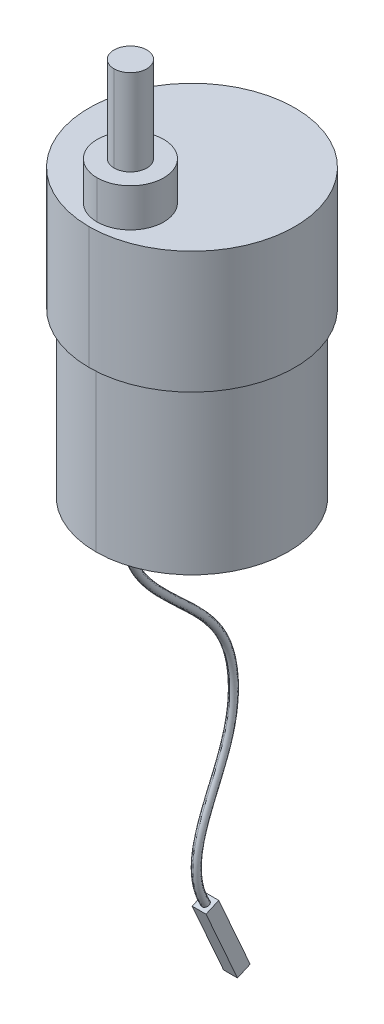
ISO-10303-21;
HEADER;
FILE_DESCRIPTION(('STEP AP214'),'2;1');
FILE_NAME('part.step','',(''),(''),'','','');
FILE_SCHEMA(('AUTOMOTIVE_DESIGN { 1 0 10303 214 1 1 1 1 }'));
ENDSEC;
DATA;
#1=APPLICATION_CONTEXT('core data for automotive mechanical design processes');
#2=APPLICATION_PROTOCOL_DEFINITION('international standard','automotive_design',2000,#1);
#3=PRODUCT_CONTEXT('',#1,'mechanical');
#4=PRODUCT('Part','Part','',(#3));
#5=PRODUCT_RELATED_PRODUCT_CATEGORY('part','',(#4));
#6=PRODUCT_DEFINITION_FORMATION('','',#4);
#7=PRODUCT_DEFINITION_CONTEXT('part definition',#1,'design');
#8=PRODUCT_DEFINITION('design','',#6,#7);
#9=PRODUCT_DEFINITION_SHAPE('','',#8);
#10=(LENGTH_UNIT() NAMED_UNIT(*) SI_UNIT(.MILLI.,.METRE.));
#11=(NAMED_UNIT(*) PLANE_ANGLE_UNIT() SI_UNIT($,.RADIAN.));
#12=(NAMED_UNIT(*) SI_UNIT($,.STERADIAN.) SOLID_ANGLE_UNIT());
#13=UNCERTAINTY_MEASURE_WITH_UNIT(LENGTH_MEASURE(1.E-05),#10,'distance_accuracy_value','');
#14=(GEOMETRIC_REPRESENTATION_CONTEXT(3) GLOBAL_UNCERTAINTY_ASSIGNED_CONTEXT((#13)) GLOBAL_UNIT_ASSIGNED_CONTEXT((#10,
#11,#12)) REPRESENTATION_CONTEXT('',''));
#15=CARTESIAN_POINT('',(0.,0.,0.));
#16=DIRECTION('',(0.,0.,1.));
#17=DIRECTION('',(1.,0.,0.));
#18=AXIS2_PLACEMENT_3D('',#15,#16,#17);
#19=CARTESIAN_POINT('',(0.,-55.0147326261418,-24.3537346097616));
#20=DIRECTION('',(0.,-0.914410504016221,-0.404788129945532));
#21=DIRECTION('',(0.,0.404788129945532,-0.914410504016221));
#22=AXIS2_PLACEMENT_3D('',#19,#20,#21);
#23=PLANE('',#22);
#24=CARTESIAN_POINT('',(0.,-64.7223606920733,-2.42434385967983));
#25=DIRECTION('',(0.,-0.914410504016226,-0.40478812994552));
#26=DIRECTION('',(0.,0.40478812994552,-0.914410504016226));
#27=AXIS2_PLACEMENT_3D('',#24,#25,#26);
#28=CIRCLE('',#27,0.65);
#29=CARTESIAN_POINT('',(0.,-64.4592484076087,-3.01871068729037));
#30=VERTEX_POINT('',#29);
#31=CARTESIAN_POINT('',(0.,-64.9854729765379,-1.82997703206929));
#32=VERTEX_POINT('',#31);
#33=EDGE_CURVE('E210',#30,#32,#28,.T.);
#34=ORIENTED_EDGE('',*,*,#33,.T.);
#35=CARTESIAN_POINT('',(0.,-64.7223606920733,-2.42434385967983));
#36=DIRECTION('',(0.,-0.914410504016226,-0.40478812994552));
#37=DIRECTION('',(0.,0.40478812994552,-0.914410504016226));
#38=AXIS2_PLACEMENT_3D('',#35,#36,#37);
#39=CIRCLE('',#38,0.65);
#40=EDGE_CURVE('E186',#32,#30,#39,.T.);
#41=ORIENTED_EDGE('',*,*,#40,.T.);
#42=EDGE_LOOP('',(#34,#41));
#43=FACE_BOUND('',#42,.T.);
#44=DIRECTION('',(-1.,0.,0.));
#45=VECTOR('',#44,1.);
#46=CARTESIAN_POINT('',(1.25,-65.2283458545052,-1.28133072965957));
#47=LINE('',#46,#45);
#48=CARTESIAN_POINT('',(1.25,-65.2283458545052,-1.28133072965957));
#49=VERTEX_POINT('',#48);
#50=CARTESIAN_POINT('',(-1.25,-65.2283458545052,-1.28133072965957));
#51=VERTEX_POINT('',#50);
#52=EDGE_CURVE('E190',#49,#51,#47,.T.);
#53=ORIENTED_EDGE('',*,*,#52,.F.);
#54=DIRECTION('',(0.,-0.404788129945532,0.914410504016221));
#55=VECTOR('',#54,1.);
#56=CARTESIAN_POINT('',(1.25,-64.2163755296414,-3.56735698970013));
#57=LINE('',#56,#55);
#58=CARTESIAN_POINT('',(1.25,-64.2163755296414,-3.56735698970013));
#59=VERTEX_POINT('',#58);
#60=EDGE_CURVE('E30',#59,#49,#57,.T.);
#61=ORIENTED_EDGE('',*,*,#60,.F.);
#62=DIRECTION('',(1.,0.,0.));
#63=VECTOR('',#62,1.);
#64=CARTESIAN_POINT('',(-1.25,-64.2163755296414,-3.56735698970013));
#65=LINE('',#64,#63);
#66=CARTESIAN_POINT('',(-1.25,-64.2163755296414,-3.56735698970013));
#67=VERTEX_POINT('',#66);
#68=EDGE_CURVE('E23',#67,#59,#65,.T.);
#69=ORIENTED_EDGE('',*,*,#68,.F.);
#70=DIRECTION('',(0.,0.404788129945532,-0.914410504016221));
#71=VECTOR('',#70,1.);
#72=CARTESIAN_POINT('',(-1.25,-65.2283458545052,-1.28133072965957));
#73=LINE('',#72,#71);
#74=EDGE_CURVE('E149',#51,#67,#73,.T.);
#75=ORIENTED_EDGE('',*,*,#74,.F.);
#76=EDGE_LOOP('',(#53,#61,#69,#75));
#77=FACE_BOUND('',#76,.T.);
#78=ADVANCED_FACE('F17',(#43,#77),#23,.F.);
#79=CARTESIAN_POINT('',(0.,-67.8164796823689,-30.020768428999));
#80=DIRECTION('',(0.,-0.914410504016221,-0.404788129945532));
#81=DIRECTION('',(0.,0.404788129945532,-0.914410504016221));
#82=AXIS2_PLACEMENT_3D('',#79,#80,#81);
#83=PLANE('',#82);
#84=DIRECTION('',(-1.,0.,0.));
#85=VECTOR('',#84,1.);
#86=CARTESIAN_POINT('',(1.25,-78.0300929107323,-6.94836454889697));
#87=LINE('',#86,#85);
#88=CARTESIAN_POINT('',(1.25,-78.0300929107323,-6.94836454889697));
#89=VERTEX_POINT('',#88);
#90=CARTESIAN_POINT('',(-1.25,-78.0300929107323,-6.94836454889697));
#91=VERTEX_POINT('',#90);
#92=EDGE_CURVE('E142',#89,#91,#87,.T.);
#93=ORIENTED_EDGE('',*,*,#92,.T.);
#94=DIRECTION('',(0.,0.404788129945532,-0.914410504016221));
#95=VECTOR('',#94,1.);
#96=CARTESIAN_POINT('',(-1.25,-78.0300929107323,-6.94836454889697));
#97=LINE('',#96,#95);
#98=CARTESIAN_POINT('',(-1.25,-77.0181225858685,-9.23439080893753));
#99=VERTEX_POINT('',#98);
#100=EDGE_CURVE('E139',#91,#99,#97,.T.);
#101=ORIENTED_EDGE('',*,*,#100,.T.);
#102=DIRECTION('',(1.,0.,0.));
#103=VECTOR('',#102,1.);
#104=CARTESIAN_POINT('',(-1.25,-77.0181225858685,-9.23439080893753));
#105=LINE('',#104,#103);
#106=CARTESIAN_POINT('',(1.25,-77.0181225858685,-9.23439080893753));
#107=VERTEX_POINT('',#106);
#108=EDGE_CURVE('E126',#99,#107,#105,.T.);
#109=ORIENTED_EDGE('',*,*,#108,.T.);
#110=DIRECTION('',(0.,-0.404788129945532,0.914410504016221));
#111=VECTOR('',#110,1.);
#112=CARTESIAN_POINT('',(1.25,-77.0181225858685,-9.23439080893753));
#113=LINE('',#112,#111);
#114=EDGE_CURVE('E11',#107,#89,#113,.T.);
#115=ORIENTED_EDGE('',*,*,#114,.T.);
#116=EDGE_LOOP('',(#93,#101,#109,#115));
#117=FACE_BOUND('',#116,.T.);
#118=ADVANCED_FACE('F140',(#117),#83,.T.);
#119=CARTESIAN_POINT('',(1.25,-77.0181225858685,-9.23439080893753));
#120=DIRECTION('',(-1.,0.,0.));
#121=DIRECTION('',(0.,0.,1.));
#122=AXIS2_PLACEMENT_3D('',#119,#120,#121);
#123=PLANE('',#122);
#124=ORIENTED_EDGE('',*,*,#60,.T.);
#125=DIRECTION('',(0.,0.914410504016222,0.404788129945528));
#126=VECTOR('',#125,1.);
#127=CARTESIAN_POINT('',(1.25,-78.0300929107323,-6.94836454889697));
#128=LINE('',#127,#126);
#129=EDGE_CURVE('E156',#89,#49,#128,.T.);
#130=ORIENTED_EDGE('',*,*,#129,.F.);
#131=ORIENTED_EDGE('',*,*,#114,.F.);
#132=DIRECTION('',(0.,0.914410504016222,0.404788129945528));
#133=VECTOR('',#132,1.);
#134=CARTESIAN_POINT('',(1.25,-77.0181225858685,-9.23439080893753));
#135=LINE('',#134,#133);
#136=EDGE_CURVE('E133',#107,#59,#135,.T.);
#137=ORIENTED_EDGE('',*,*,#136,.T.);
#138=EDGE_LOOP('',(#124,#130,#131,#137));
#139=FACE_BOUND('',#138,.T.);
#140=ADVANCED_FACE('F265',(#139),#123,.F.);
#141=CARTESIAN_POINT('',(-1.25,-77.0181225858685,-9.23439080893753));
#142=DIRECTION('',(0.,-0.404788129945528,0.914410504016222));
#143=DIRECTION('',(-1.,0.,0.));
#144=AXIS2_PLACEMENT_3D('',#141,#142,#143);
#145=PLANE('',#144);
#146=ORIENTED_EDGE('',*,*,#68,.T.);
#147=ORIENTED_EDGE('',*,*,#136,.F.);
#148=ORIENTED_EDGE('',*,*,#108,.F.);
#149=DIRECTION('',(0.,0.914410504016222,0.404788129945528));
#150=VECTOR('',#149,1.);
#151=CARTESIAN_POINT('',(-1.25,-77.0181225858685,-9.23439080893753));
#152=LINE('',#151,#150);
#153=EDGE_CURVE('E131',#99,#67,#152,.T.);
#154=ORIENTED_EDGE('',*,*,#153,.T.);
#155=EDGE_LOOP('',(#146,#147,#148,#154));
#156=FACE_BOUND('',#155,.T.);
#157=ADVANCED_FACE('F129',(#156),#145,.F.);
#158=CARTESIAN_POINT('',(-1.25,-78.0300929107323,-6.94836454889697));
#159=DIRECTION('',(1.,0.,0.));
#160=DIRECTION('',(0.,0.,1.));
#161=AXIS2_PLACEMENT_3D('',#158,#159,#160);
#162=PLANE('',#161);
#163=ORIENTED_EDGE('',*,*,#74,.T.);
#164=ORIENTED_EDGE('',*,*,#153,.F.);
#165=ORIENTED_EDGE('',*,*,#100,.F.);
#166=DIRECTION('',(0.,0.914410504016222,0.404788129945528));
#167=VECTOR('',#166,1.);
#168=CARTESIAN_POINT('',(-1.25,-78.0300929107323,-6.94836454889697));
#169=LINE('',#168,#167);
#170=EDGE_CURVE('E195',#91,#51,#169,.T.);
#171=ORIENTED_EDGE('',*,*,#170,.T.);
#172=EDGE_LOOP('',(#163,#164,#165,#171));
#173=FACE_BOUND('',#172,.T.);
#174=ADVANCED_FACE('F148',(#173),#162,.F.);
#175=CARTESIAN_POINT('',(1.25,-78.0300929107323,-6.94836454889697));
#176=DIRECTION('',(0.,0.404788129945528,-0.914410504016222));
#177=DIRECTION('',(-1.,0.,0.));
#178=AXIS2_PLACEMENT_3D('',#175,#176,#177);
#179=PLANE('',#178);
#180=ORIENTED_EDGE('',*,*,#52,.T.);
#181=ORIENTED_EDGE('',*,*,#170,.F.);
#182=ORIENTED_EDGE('',*,*,#92,.F.);
#183=ORIENTED_EDGE('',*,*,#129,.T.);
#184=EDGE_LOOP('',(#180,#181,#182,#183));
#185=FACE_BOUND('',#184,.T.);
#186=ADVANCED_FACE('F271',(#185),#179,.F.);
#187=CARTESIAN_POINT('',(0.,0.,12.65));
#188=CARTESIAN_POINT('',(0.,-2.94508597447817,12.4221320995553));
#189=CARTESIAN_POINT('',(0.,-5.4510477209894,11.4643707065353));
#190=CARTESIAN_POINT('',(0.,-9.86280286559184,8.73518139959936));
#191=CARTESIAN_POINT('',(0.,-11.7739584150813,6.96988376922254));
#192=CARTESIAN_POINT('',(0.,-17.2037332541465,1.40262029181695));
#193=CARTESIAN_POINT('',(0.,-20.4365862628114,-2.65453861440402));
#194=CARTESIAN_POINT('',(0.,-28.8274141781325,-6.94249034266679));
#195=CARTESIAN_POINT('',(0.,-34.1326729879684,-7.31428293315415));
#196=CARTESIAN_POINT('',(0.,-43.4025857579736,-5.14712333658673));
#197=CARTESIAN_POINT('',(0.,-47.5323174776611,-2.86793592251471));
#198=CARTESIAN_POINT('',(0.,-53.8521649333888,-0.675203239836204));
#199=CARTESIAN_POINT('',(0.,-55.9866849765013,-0.150542574307158));
#200=CARTESIAN_POINT('',(0.,-60.3947273715979,-0.098549934723846));
#201=CARTESIAN_POINT('',(0.,-62.6646128417333,-0.580780996059781));
#202=CARTESIAN_POINT('',(0.,-64.9854729765379,-1.82997703206929));
#203=CARTESIAN_POINT('',(-1.3,0.,12.65));
#204=CARTESIAN_POINT('',(-1.3,-2.94508597447817,12.4221320995553));
#205=CARTESIAN_POINT('',(-1.3,-5.45104772098939,11.4643707065353));
#206=CARTESIAN_POINT('',(-1.3,-9.86280286559183,8.73518139959935));
#207=CARTESIAN_POINT('',(-1.3,-11.7739584150813,6.96988376922255));
#208=CARTESIAN_POINT('',(-1.3,-17.2037332541465,1.40262029181695));
#209=CARTESIAN_POINT('',(-1.3,-20.4365862628114,-2.65453861440402));
#210=CARTESIAN_POINT('',(-1.3,-28.8274141781325,-6.94249034266678));
#211=CARTESIAN_POINT('',(-1.3,-34.1326729879684,-7.31428293315415));
#212=CARTESIAN_POINT('',(-1.3,-43.4025857579736,-5.14712333658673));
#213=CARTESIAN_POINT('',(-1.3,-47.5323174776611,-2.86793592251471));
#214=CARTESIAN_POINT('',(-1.3,-53.8521649333887,-0.675203239836204));
#215=CARTESIAN_POINT('',(-1.3,-55.9866849765013,-0.150542574307158));
#216=CARTESIAN_POINT('',(-1.3,-60.3947273715979,-0.0985499347238459));
#217=CARTESIAN_POINT('',(-1.3,-62.6646128417332,-0.58078099605978));
#218=CARTESIAN_POINT('',(-1.3,-64.9854729765379,-1.82997703206929));
#219=CARTESIAN_POINT('',(-1.3,0.,11.35));
#220=CARTESIAN_POINT('',(-1.3,-2.72297593374063,11.1221320993654));
#221=CARTESIAN_POINT('',(-1.3,-5.00215693324374,10.2331416397973));
#222=CARTESIAN_POINT('',(-1.3,-9.11955441032927,7.65582525360883));
#223=CARTESIAN_POINT('',(-1.3,-10.9524087292984,5.96136903183279));
#224=CARTESIAN_POINT('',(-1.3,-16.2800223976183,0.483413186728767));
#225=CARTESIAN_POINT('',(-1.3,-19.5859068972608,-3.71085119959601));
#226=CARTESIAN_POINT('',(-1.3,-28.6874121097851,-8.29004479228079));
#227=CARTESIAN_POINT('',(-1.3,-34.2758885455149,-8.63404704726913));
#228=CARTESIAN_POINT('',(-1.3,-44.0308335983493,-6.31042850093244));
#229=CARTESIAN_POINT('',(-1.3,-48.2019362741022,-3.99388933417028));
#230=CARTESIAN_POINT('',(-1.3,-54.2995445510352,-1.8984740934069));
#231=CARTESIAN_POINT('',(-1.3,-56.2985437731357,-1.4279924247951));
#232=CARTESIAN_POINT('',(-1.3,-60.3124856434885,-1.41094100634713));
#233=CARTESIAN_POINT('',(-1.3,-62.3310651711934,-1.85480820556681));
#234=CARTESIAN_POINT('',(-1.3,-64.4592484076086,-3.01871068729037));
#235=CARTESIAN_POINT('',(0.,0.,11.35));
#236=CARTESIAN_POINT('',(0.,-2.72297593374063,11.1221320993654));
#237=CARTESIAN_POINT('',(0.,-5.00215693324374,10.2331416397973));
#238=CARTESIAN_POINT('',(0.,-9.11955441032927,7.65582525360884));
#239=CARTESIAN_POINT('',(0.,-10.9524087292985,5.9613690318328));
#240=CARTESIAN_POINT('',(0.,-16.2800223976183,0.483413186728767));
#241=CARTESIAN_POINT('',(0.,-19.5859068972608,-3.710851199596));
#242=CARTESIAN_POINT('',(0.,-28.6874121097851,-8.2900447922808));
#243=CARTESIAN_POINT('',(0.,-34.275888545515,-8.63404704726914));
#244=CARTESIAN_POINT('',(0.,-44.0308335983493,-6.31042850093243));
#245=CARTESIAN_POINT('',(0.,-48.2019362741023,-3.99388933417028));
#246=CARTESIAN_POINT('',(0.,-54.2995445510352,-1.8984740934069));
#247=CARTESIAN_POINT('',(0.,-56.2985437731357,-1.4279924247951));
#248=CARTESIAN_POINT('',(0.,-60.3124856434886,-1.41094100634713));
#249=CARTESIAN_POINT('',(0.,-62.3310651711935,-1.8548082055668));
#250=CARTESIAN_POINT('',(0.,-64.4592484076087,-3.01871068729037));
#251=(BOUNDED_SURFACE() B_SPLINE_SURFACE(3,3,((#187,#188,#189,#190,#191,#192,#193,#194,#195,
#196,#197,#198,#199,#200,#201,#202),(#203,#204,#205,#206,#207,#208,#209,#210,#211,#212,#213,
#214,#215,#216,#217,#218),(#219,#220,#221,#222,#223,#224,#225,#226,#227,#228,#229,#230,#231,
#232,#233,#234),(#235,#236,#237,#238,#239,#240,#241,#242,#243,#244,#245,#246,#247,#248,#249,
#250)),.UNSPECIFIED.,.F.,.F.,.F.) B_SPLINE_SURFACE_WITH_KNOTS((4,4),(4,2,2,2,2,2,2,4),(0.5,1.),
(0.,0.105175367804045,0.210350735608091,0.420701471216182,0.628255178213897,0.814127589106948,
0.907063794553474,1.),
.UNSPECIFIED.) GEOMETRIC_REPRESENTATION_ITEM() RATIONAL_B_SPLINE_SURFACE(((1.,1.,1.,1.,1.,1.,1.,
1.,1.,1.,1.,1.,1.,1.,1.,1.),(0.333333333333334,0.333333333333334,0.333333333333334,
0.333333333333334,0.333333333333334,0.333333333333334,0.333333333333334,0.333333333333334,
0.333333333333334,0.333333333333334,0.333333333333334,0.333333333333334,0.333333333333334,
0.333333333333334,0.333333333333334,0.333333333333334),(0.333333333333334,0.333333333333334,
0.333333333333334,0.333333333333334,0.333333333333334,0.333333333333334,0.333333333333334,
0.333333333333334,0.333333333333334,0.333333333333334,0.333333333333334,0.333333333333334,
0.333333333333334,0.333333333333334,0.333333333333334,0.333333333333334),(1.,1.,1.,1.,1.,1.,1.,
1.,1.,1.,1.,1.,1.,1.,1.,1.))) REPRESENTATION_ITEM('') SURFACE());
#252=CARTESIAN_POINT('',(0.,0.,12.65));
#253=CARTESIAN_POINT('',(0.,-2.94508597447817,12.4221320995553));
#254=CARTESIAN_POINT('',(0.,-5.4510477209894,11.4643707065353));
#255=CARTESIAN_POINT('',(0.,-9.86280286559184,8.73518139959936));
#256=CARTESIAN_POINT('',(0.,-11.7739584150813,6.96988376922254));
#257=CARTESIAN_POINT('',(0.,-17.2037332541465,1.40262029181695));
#258=CARTESIAN_POINT('',(0.,-20.4365862628114,-2.65453861440402));
#259=CARTESIAN_POINT('',(0.,-28.8274141781325,-6.94249034266679));
#260=CARTESIAN_POINT('',(0.,-34.1326729879684,-7.31428293315415));
#261=CARTESIAN_POINT('',(0.,-43.4025857579736,-5.14712333658673));
#262=CARTESIAN_POINT('',(0.,-47.5323174776611,-2.86793592251471));
#263=CARTESIAN_POINT('',(0.,-53.8521649333888,-0.675203239836204));
#264=CARTESIAN_POINT('',(0.,-55.9866849765013,-0.150542574307158));
#265=CARTESIAN_POINT('',(0.,-60.3947273715979,-0.098549934723846));
#266=CARTESIAN_POINT('',(0.,-62.6646128417333,-0.580780996059781));
#267=CARTESIAN_POINT('',(0.,-64.9854729765379,-1.82997703206929));
#268=(BOUNDED_CURVE() B_SPLINE_CURVE(3,(#252,#253,#254,#255,#256,#257,#258,#259,#260,#261,#262,
#263,#264,#265,#266,#267),.UNSPECIFIED.,.F.,.F.) B_SPLINE_CURVE_WITH_KNOTS((4,2,2,2,2,2,2,4),
(0.,0.105175367804045,0.210350735608091,0.420701471216182,0.628255178213897,0.814127589106948,
0.907063794553474,1.),
.UNSPECIFIED.) CURVE() GEOMETRIC_REPRESENTATION_ITEM() RATIONAL_B_SPLINE_CURVE((1.,1.,1.,1.,1.,
1.,1.,1.,1.,1.,1.,1.,1.,1.,1.,1.)) REPRESENTATION_ITEM(''));
#269=CARTESIAN_POINT('',(0.,0.,12.65));
#270=VERTEX_POINT('',#269);
#271=EDGE_CURVE('E217',#270,#32,#268,.T.);
#272=CARTESIAN_POINT('',(0.,0.,12.));
#273=DIRECTION('',(0.,-1.,0.));
#274=DIRECTION('',(0.,0.,-1.));
#275=AXIS2_PLACEMENT_3D('',#272,#273,#274);
#276=CIRCLE('',#275,0.65);
#277=CARTESIAN_POINT('',(0.,0.,11.35));
#278=VERTEX_POINT('',#277);
#279=EDGE_CURVE('E162',#270,#278,#276,.T.);
#280=CARTESIAN_POINT('',(0.,0.,11.35));
#281=CARTESIAN_POINT('',(0.,-2.72297593374063,11.1221320993654));
#282=CARTESIAN_POINT('',(0.,-5.00215693324374,10.2331416397973));
#283=CARTESIAN_POINT('',(0.,-9.11955441032927,7.65582525360884));
#284=CARTESIAN_POINT('',(0.,-10.9524087292985,5.9613690318328));
#285=CARTESIAN_POINT('',(0.,-16.2800223976183,0.483413186728767));
#286=CARTESIAN_POINT('',(0.,-19.5859068972608,-3.710851199596));
#287=CARTESIAN_POINT('',(0.,-28.6874121097851,-8.2900447922808));
#288=CARTESIAN_POINT('',(0.,-34.275888545515,-8.63404704726914));
#289=CARTESIAN_POINT('',(0.,-44.0308335983493,-6.31042850093243));
#290=CARTESIAN_POINT('',(0.,-48.2019362741023,-3.99388933417028));
#291=CARTESIAN_POINT('',(0.,-54.2995445510352,-1.8984740934069));
#292=CARTESIAN_POINT('',(0.,-56.2985437731357,-1.4279924247951));
#293=CARTESIAN_POINT('',(0.,-60.3124856434886,-1.41094100634713));
#294=CARTESIAN_POINT('',(0.,-62.3310651711935,-1.8548082055668));
#295=CARTESIAN_POINT('',(0.,-64.4592484076087,-3.01871068729037));
#296=(BOUNDED_CURVE() B_SPLINE_CURVE(3,(#280,#281,#282,#283,#284,#285,#286,#287,#288,#289,#290,
#291,#292,#293,#294,#295),.UNSPECIFIED.,.F.,.F.) B_SPLINE_CURVE_WITH_KNOTS((4,2,2,2,2,2,2,4),
(0.,0.105175367804045,0.210350735608091,0.420701471216182,0.628255178213897,0.814127589106948,
0.907063794553474,1.),
.UNSPECIFIED.) CURVE() GEOMETRIC_REPRESENTATION_ITEM() RATIONAL_B_SPLINE_CURVE((1.,1.,1.,1.,1.,
1.,1.,1.,1.,1.,1.,1.,1.,1.,1.,1.)) REPRESENTATION_ITEM(''));
#297=EDGE_CURVE('E204',#278,#30,#296,.T.);
#298=ORIENTED_EDGE('',*,*,#271,.F.);
#299=ORIENTED_EDGE('',*,*,#279,.T.);
#300=ORIENTED_EDGE('',*,*,#297,.T.);
#301=ORIENTED_EDGE('',*,*,#40,.F.);
#302=EDGE_LOOP('',(#298,#299,#300,#301));
#303=FACE_BOUND('',#302,.T.);
#304=ADVANCED_FACE('F353',(#303),#251,.T.);
#305=CARTESIAN_POINT('',(0.,73.8,11.1));
#306=DIRECTION('',(0.,1.,0.));
#307=DIRECTION('',(1.,0.,0.));
#308=AXIS2_PLACEMENT_3D('',#305,#306,#307);
#309=PLANE('',#308);
#310=CARTESIAN_POINT('',(0.,73.8,11.1));
#311=DIRECTION('',(0.,1.,0.));
#312=DIRECTION('',(0.,0.,1.));
#313=AXIS2_PLACEMENT_3D('',#310,#311,#312);
#314=CIRCLE('',#313,2.95);
#315=CARTESIAN_POINT('',(0.,73.8,8.15));
#316=VERTEX_POINT('',#315);
#317=CARTESIAN_POINT('',(0.,73.8,14.05));
#318=VERTEX_POINT('',#317);
#319=EDGE_CURVE('E191',#316,#318,#314,.T.);
#320=ORIENTED_EDGE('',*,*,#319,.T.);
#321=CARTESIAN_POINT('',(0.,73.8,11.1));
#322=DIRECTION('',(0.,1.,0.));
#323=DIRECTION('',(0.,0.,1.));
#324=AXIS2_PLACEMENT_3D('',#321,#322,#323);
#325=CIRCLE('',#324,2.95);
#326=EDGE_CURVE('E179',#318,#316,#325,.T.);
#327=ORIENTED_EDGE('',*,*,#326,.T.);
#328=EDGE_LOOP('',(#320,#327));
#329=FACE_BOUND('',#328,.T.);
#330=ADVANCED_FACE('F351',(#329),#309,.T.);
#331=CARTESIAN_POINT('',(0.,73.8,11.1));
#332=DIRECTION('',(0.,-1.,0.));
#333=DIRECTION('',(0.,0.,-1.));
#334=AXIS2_PLACEMENT_3D('',#331,#332,#333);
#335=CYLINDRICAL_SURFACE('',#334,2.95);
#336=DIRECTION('',(0.,-1.,0.));
#337=VECTOR('',#336,1.);
#338=CARTESIAN_POINT('',(0.,73.8,14.05));
#339=LINE('',#338,#337);
#340=CARTESIAN_POINT('',(0.,58.3,14.05));
#341=VERTEX_POINT('',#340);
#342=EDGE_CURVE('E175',#318,#341,#339,.T.);
#343=ORIENTED_EDGE('',*,*,#342,.F.);
#344=ORIENTED_EDGE('',*,*,#319,.F.);
#345=DIRECTION('',(0.,-1.,0.));
#346=VECTOR('',#345,1.);
#347=CARTESIAN_POINT('',(0.,73.8,8.15));
#348=LINE('',#347,#346);
#349=CARTESIAN_POINT('',(0.,58.3,8.15));
#350=VERTEX_POINT('',#349);
#351=EDGE_CURVE('E169',#316,#350,#348,.T.);
#352=ORIENTED_EDGE('',*,*,#351,.T.);
#353=CARTESIAN_POINT('',(0.,58.3,11.1));
#354=DIRECTION('',(0.,1.,0.));
#355=DIRECTION('',(0.,0.,1.));
#356=AXIS2_PLACEMENT_3D('',#353,#354,#355);
#357=CIRCLE('',#356,2.95);
#358=EDGE_CURVE('E258',#350,#341,#357,.T.);
#359=ORIENTED_EDGE('',*,*,#358,.T.);
#360=EDGE_LOOP('',(#343,#344,#352,#359));
#361=FACE_BOUND('',#360,.T.);
#362=ADVANCED_FACE('F349',(#361),#335,.T.);
#363=CARTESIAN_POINT('',(0.,58.3,11.1));
#364=DIRECTION('',(0.,1.,0.));
#365=DIRECTION('',(1.,0.,0.));
#366=AXIS2_PLACEMENT_3D('',#363,#364,#365);
#367=PLANE('',#366);
#368=ORIENTED_EDGE('',*,*,#358,.F.);
#369=CARTESIAN_POINT('',(0.,58.3,11.1));
#370=DIRECTION('',(0.,1.,0.));
#371=DIRECTION('',(0.,0.,1.));
#372=AXIS2_PLACEMENT_3D('',#369,#370,#371);
#373=CIRCLE('',#372,2.95);
#374=EDGE_CURVE('E174',#341,#350,#373,.T.);
#375=ORIENTED_EDGE('',*,*,#374,.F.);
#376=EDGE_LOOP('',(#368,#375));
#377=FACE_BOUND('',#376,.T.);
#378=CARTESIAN_POINT('',(0.,58.3,11.1));
#379=DIRECTION('',(0.,1.,0.));
#380=DIRECTION('',(0.,0.,1.));
#381=AXIS2_PLACEMENT_3D('',#378,#379,#380);
#382=CIRCLE('',#381,6.);
#383=CARTESIAN_POINT('',(0.,58.3,5.1));
#384=VERTEX_POINT('',#383);
#385=CARTESIAN_POINT('',(0.,58.3,17.1));
#386=VERTEX_POINT('',#385);
#387=EDGE_CURVE('E235',#384,#386,#382,.T.);
#388=ORIENTED_EDGE('',*,*,#387,.T.);
#389=CARTESIAN_POINT('',(0.,58.3,11.1));
#390=DIRECTION('',(0.,1.,0.));
#391=DIRECTION('',(0.,0.,1.));
#392=AXIS2_PLACEMENT_3D('',#389,#390,#391);
#393=CIRCLE('',#392,6.);
#394=EDGE_CURVE('E173',#386,#384,#393,.T.);
#395=ORIENTED_EDGE('',*,*,#394,.T.);
#396=EDGE_LOOP('',(#388,#395));
#397=FACE_BOUND('',#396,.T.);
#398=ADVANCED_FACE('F346',(#377,#397),#367,.T.);
#399=CARTESIAN_POINT('',(0.,58.3,11.1));
#400=DIRECTION('',(0.,-1.,0.));
#401=DIRECTION('',(0.,0.,-1.));
#402=AXIS2_PLACEMENT_3D('',#399,#400,#401);
#403=CYLINDRICAL_SURFACE('',#402,6.);
#404=DIRECTION('',(0.,-1.,0.));
#405=VECTOR('',#404,1.);
#406=CARTESIAN_POINT('',(0.,58.3,17.1));
#407=LINE('',#406,#405);
#408=CARTESIAN_POINT('',(0.,51.4,17.1));
#409=VERTEX_POINT('',#408);
#410=EDGE_CURVE('E220',#386,#409,#407,.T.);
#411=ORIENTED_EDGE('',*,*,#410,.F.);
#412=ORIENTED_EDGE('',*,*,#387,.F.);
#413=DIRECTION('',(0.,-1.,0.));
#414=VECTOR('',#413,1.);
#415=CARTESIAN_POINT('',(0.,58.3,5.1));
#416=LINE('',#415,#414);
#417=CARTESIAN_POINT('',(0.,51.4,5.1));
#418=VERTEX_POINT('',#417);
#419=EDGE_CURVE('E238',#384,#418,#416,.T.);
#420=ORIENTED_EDGE('',*,*,#419,.T.);
#421=CARTESIAN_POINT('',(0.,51.4,11.1));
#422=DIRECTION('',(0.,1.,0.));
#423=DIRECTION('',(0.,0.,1.));
#424=AXIS2_PLACEMENT_3D('',#421,#422,#423);
#425=CIRCLE('',#424,6.);
#426=EDGE_CURVE('E232',#418,#409,#425,.T.);
#427=ORIENTED_EDGE('',*,*,#426,.T.);
#428=EDGE_LOOP('',(#411,#412,#420,#427));
#429=FACE_BOUND('',#428,.T.);
#430=ADVANCED_FACE('F376',(#429),#403,.T.);
#431=CARTESIAN_POINT('',(0.,29.4,0.));
#432=DIRECTION('',(0.,1.,0.));
#433=DIRECTION('',(1.,0.,0.));
#434=AXIS2_PLACEMENT_3D('',#431,#432,#433);
#435=PLANE('',#434);
#436=CARTESIAN_POINT('',(0.,29.4,0.));
#437=DIRECTION('',(0.,1.,0.));
#438=DIRECTION('',(0.,0.,1.));
#439=AXIS2_PLACEMENT_3D('',#436,#437,#438);
#440=CIRCLE('',#439,17.325);
#441=CARTESIAN_POINT('',(0.,29.4,-17.325));
#442=VERTEX_POINT('',#441);
#443=CARTESIAN_POINT('',(0.,29.4,17.325));
#444=VERTEX_POINT('',#443);
#445=EDGE_CURVE('E249',#442,#444,#440,.T.);
#446=ORIENTED_EDGE('',*,*,#445,.T.);
#447=CARTESIAN_POINT('',(0.,29.4,0.));
#448=DIRECTION('',(0.,1.,0.));
#449=DIRECTION('',(0.,0.,1.));
#450=AXIS2_PLACEMENT_3D('',#447,#448,#449);
#451=CIRCLE('',#450,17.325);
#452=EDGE_CURVE('E185',#444,#442,#451,.T.);
#453=ORIENTED_EDGE('',*,*,#452,.T.);
#454=EDGE_LOOP('',(#446,#453));
#455=FACE_BOUND('',#454,.T.);
#456=CARTESIAN_POINT('',(0.,29.4,0.));
#457=DIRECTION('',(0.,1.,0.));
#458=DIRECTION('',(0.,0.,1.));
#459=AXIS2_PLACEMENT_3D('',#456,#457,#458);
#460=CIRCLE('',#459,18.55);
#461=CARTESIAN_POINT('',(0.,29.4,-18.55));
#462=VERTEX_POINT('',#461);
#463=CARTESIAN_POINT('',(0.,29.4,18.55));
#464=VERTEX_POINT('',#463);
#465=EDGE_CURVE('E236',#462,#464,#460,.T.);
#466=ORIENTED_EDGE('',*,*,#465,.F.);
#467=CARTESIAN_POINT('',(0.,29.4,0.));
#468=DIRECTION('',(0.,1.,0.));
#469=DIRECTION('',(0.,0.,1.));
#470=AXIS2_PLACEMENT_3D('',#467,#468,#469);
#471=CIRCLE('',#470,18.55);
#472=EDGE_CURVE('E159',#464,#462,#471,.T.);
#473=ORIENTED_EDGE('',*,*,#472,.F.);
#474=EDGE_LOOP('',(#466,#473));
#475=FACE_BOUND('',#474,.T.);
#476=ADVANCED_FACE('F299',(#455,#475),#435,.F.);
#477=CARTESIAN_POINT('',(0.,51.4,0.));
#478=DIRECTION('',(0.,1.,0.));
#479=DIRECTION('',(1.,0.,0.));
#480=AXIS2_PLACEMENT_3D('',#477,#478,#479);
#481=PLANE('',#480);
#482=ORIENTED_EDGE('',*,*,#426,.F.);
#483=CARTESIAN_POINT('',(0.,51.4,11.1));
#484=DIRECTION('',(0.,1.,0.));
#485=DIRECTION('',(0.,0.,1.));
#486=AXIS2_PLACEMENT_3D('',#483,#484,#485);
#487=CIRCLE('',#486,6.);
#488=EDGE_CURVE('E224',#409,#418,#487,.T.);
#489=ORIENTED_EDGE('',*,*,#488,.F.);
#490=EDGE_LOOP('',(#482,#489));
#491=FACE_BOUND('',#490,.T.);
#492=CARTESIAN_POINT('',(0.,51.4,0.));
#493=DIRECTION('',(0.,1.,0.));
#494=DIRECTION('',(0.,0.,1.));
#495=AXIS2_PLACEMENT_3D('',#492,#493,#494);
#496=CIRCLE('',#495,18.55);
#497=CARTESIAN_POINT('',(0.,51.4,-18.55));
#498=VERTEX_POINT('',#497);
#499=CARTESIAN_POINT('',(0.,51.4,18.55));
#500=VERTEX_POINT('',#499);
#501=EDGE_CURVE('E165',#498,#500,#496,.T.);
#502=ORIENTED_EDGE('',*,*,#501,.T.);
#503=CARTESIAN_POINT('',(0.,51.4,0.));
#504=DIRECTION('',(0.,1.,0.));
#505=DIRECTION('',(0.,0.,1.));
#506=AXIS2_PLACEMENT_3D('',#503,#504,#505);
#507=CIRCLE('',#506,18.55);
#508=EDGE_CURVE('E203',#500,#498,#507,.T.);
#509=ORIENTED_EDGE('',*,*,#508,.T.);
#510=EDGE_LOOP('',(#502,#509));
#511=FACE_BOUND('',#510,.T.);
#512=ADVANCED_FACE('F385',(#491,#511),#481,.T.);
#513=CARTESIAN_POINT('',(0.,51.4,0.));
#514=DIRECTION('',(0.,-1.,0.));
#515=DIRECTION('',(0.,0.,-1.));
#516=AXIS2_PLACEMENT_3D('',#513,#514,#515);
#517=CYLINDRICAL_SURFACE('',#516,18.55);
#518=DIRECTION('',(0.,-1.,0.));
#519=VECTOR('',#518,1.);
#520=CARTESIAN_POINT('',(0.,51.4,18.55));
#521=LINE('',#520,#519);
#522=EDGE_CURVE('E199',#500,#464,#521,.T.);
#523=ORIENTED_EDGE('',*,*,#522,.F.);
#524=ORIENTED_EDGE('',*,*,#501,.F.);
#525=DIRECTION('',(0.,-1.,0.));
#526=VECTOR('',#525,1.);
#527=CARTESIAN_POINT('',(0.,51.4,-18.55));
#528=LINE('',#527,#526);
#529=EDGE_CURVE('E231',#498,#462,#528,.T.);
#530=ORIENTED_EDGE('',*,*,#529,.T.);
#531=ORIENTED_EDGE('',*,*,#465,.T.);
#532=EDGE_LOOP('',(#523,#524,#530,#531));
#533=FACE_BOUND('',#532,.T.);
#534=ADVANCED_FACE('F292',(#533),#517,.T.);
#535=CARTESIAN_POINT('',(0.,0.,0.));
#536=DIRECTION('',(0.,1.,0.));
#537=DIRECTION('',(1.,0.,0.));
#538=AXIS2_PLACEMENT_3D('',#535,#536,#537);
#539=PLANE('',#538);
#540=CARTESIAN_POINT('',(0.,0.,12.));
#541=DIRECTION('',(0.,-1.,0.));
#542=DIRECTION('',(0.,0.,-1.));
#543=AXIS2_PLACEMENT_3D('',#540,#541,#542);
#544=CIRCLE('',#543,0.65);
#545=EDGE_CURVE('E318',#278,#270,#544,.T.);
#546=ORIENTED_EDGE('',*,*,#545,.F.);
#547=ORIENTED_EDGE('',*,*,#279,.F.);
#548=EDGE_LOOP('',(#546,#547));
#549=FACE_BOUND('',#548,.T.);
#550=CARTESIAN_POINT('',(0.,0.,0.));
#551=DIRECTION('',(0.,1.,0.));
#552=DIRECTION('',(0.,0.,1.));
#553=AXIS2_PLACEMENT_3D('',#550,#551,#552);
#554=CIRCLE('',#553,17.325);
#555=CARTESIAN_POINT('',(0.,0.,-17.325));
#556=VERTEX_POINT('',#555);
#557=CARTESIAN_POINT('',(0.,0.,17.325));
#558=VERTEX_POINT('',#557);
#559=EDGE_CURVE('E166',#556,#558,#554,.T.);
#560=ORIENTED_EDGE('',*,*,#559,.F.);
#561=CARTESIAN_POINT('',(0.,0.,0.));
#562=DIRECTION('',(0.,1.,0.));
#563=DIRECTION('',(0.,0.,1.));
#564=AXIS2_PLACEMENT_3D('',#561,#562,#563);
#565=CIRCLE('',#564,17.325);
#566=EDGE_CURVE('E184',#558,#556,#565,.T.);
#567=ORIENTED_EDGE('',*,*,#566,.F.);
#568=EDGE_LOOP('',(#560,#567));
#569=FACE_BOUND('',#568,.T.);
#570=ADVANCED_FACE('F394',(#549,#569),#539,.F.);
#571=CARTESIAN_POINT('',(0.,29.4,0.));
#572=DIRECTION('',(0.,-1.,0.));
#573=DIRECTION('',(0.,0.,-1.));
#574=AXIS2_PLACEMENT_3D('',#571,#572,#573);
#575=CYLINDRICAL_SURFACE('',#574,17.325);
#576=DIRECTION('',(0.,-1.,0.));
#577=VECTOR('',#576,1.);
#578=CARTESIAN_POINT('',(0.,29.4,17.325));
#579=LINE('',#578,#577);
#580=EDGE_CURVE('E180',#444,#558,#579,.T.);
#581=ORIENTED_EDGE('',*,*,#580,.F.);
#582=ORIENTED_EDGE('',*,*,#445,.F.);
#583=DIRECTION('',(0.,-1.,0.));
#584=VECTOR('',#583,1.);
#585=CARTESIAN_POINT('',(0.,29.4,-17.325));
#586=LINE('',#585,#584);
#587=EDGE_CURVE('E248',#442,#556,#586,.T.);
#588=ORIENTED_EDGE('',*,*,#587,.T.);
#589=ORIENTED_EDGE('',*,*,#559,.T.);
#590=EDGE_LOOP('',(#581,#582,#588,#589));
#591=FACE_BOUND('',#590,.T.);
#592=ADVANCED_FACE('F392',(#591),#575,.T.);
#593=CARTESIAN_POINT('',(0.,29.4,0.));
#594=DIRECTION('',(0.,-1.,0.));
#595=DIRECTION('',(0.,0.,-1.));
#596=AXIS2_PLACEMENT_3D('',#593,#594,#595);
#597=CYLINDRICAL_SURFACE('',#596,17.325);
#598=ORIENTED_EDGE('',*,*,#452,.F.);
#599=ORIENTED_EDGE('',*,*,#580,.T.);
#600=ORIENTED_EDGE('',*,*,#566,.T.);
#601=ORIENTED_EDGE('',*,*,#587,.F.);
#602=EDGE_LOOP('',(#598,#599,#600,#601));
#603=FACE_BOUND('',#602,.T.);
#604=ADVANCED_FACE('F391',(#603),#597,.T.);
#605=CARTESIAN_POINT('',(0.,51.4,0.));
#606=DIRECTION('',(0.,-1.,0.));
#607=DIRECTION('',(0.,0.,-1.));
#608=AXIS2_PLACEMENT_3D('',#605,#606,#607);
#609=CYLINDRICAL_SURFACE('',#608,18.55);
#610=ORIENTED_EDGE('',*,*,#508,.F.);
#611=ORIENTED_EDGE('',*,*,#522,.T.);
#612=ORIENTED_EDGE('',*,*,#472,.T.);
#613=ORIENTED_EDGE('',*,*,#529,.F.);
#614=EDGE_LOOP('',(#610,#611,#612,#613));
#615=FACE_BOUND('',#614,.T.);
#616=ADVANCED_FACE('F301',(#615),#609,.T.);
#617=CARTESIAN_POINT('',(0.,58.3,11.1));
#618=DIRECTION('',(0.,-1.,0.));
#619=DIRECTION('',(0.,0.,-1.));
#620=AXIS2_PLACEMENT_3D('',#617,#618,#619);
#621=CYLINDRICAL_SURFACE('',#620,6.);
#622=ORIENTED_EDGE('',*,*,#394,.F.);
#623=ORIENTED_EDGE('',*,*,#410,.T.);
#624=ORIENTED_EDGE('',*,*,#488,.T.);
#625=ORIENTED_EDGE('',*,*,#419,.F.);
#626=EDGE_LOOP('',(#622,#623,#624,#625));
#627=FACE_BOUND('',#626,.T.);
#628=ADVANCED_FACE('F398',(#627),#621,.T.);
#629=CARTESIAN_POINT('',(0.,73.8,11.1));
#630=DIRECTION('',(0.,-1.,0.));
#631=DIRECTION('',(0.,0.,-1.));
#632=AXIS2_PLACEMENT_3D('',#629,#630,#631);
#633=CYLINDRICAL_SURFACE('',#632,2.95);
#634=ORIENTED_EDGE('',*,*,#326,.F.);
#635=ORIENTED_EDGE('',*,*,#342,.T.);
#636=ORIENTED_EDGE('',*,*,#374,.T.);
#637=ORIENTED_EDGE('',*,*,#351,.F.);
#638=EDGE_LOOP('',(#634,#635,#636,#637));
#639=FACE_BOUND('',#638,.T.);
#640=ADVANCED_FACE('F343',(#639),#633,.T.);
#641=CARTESIAN_POINT('',(0.,0.,11.35));
#642=CARTESIAN_POINT('',(0.,-2.72297593374063,11.1221320993654));
#643=CARTESIAN_POINT('',(0.,-5.00215693324374,10.2331416397973));
#644=CARTESIAN_POINT('',(0.,-9.11955441032927,7.65582525360884));
#645=CARTESIAN_POINT('',(0.,-10.9524087292985,5.9613690318328));
#646=CARTESIAN_POINT('',(0.,-16.2800223976183,0.483413186728767));
#647=CARTESIAN_POINT('',(0.,-19.5859068972608,-3.710851199596));
#648=CARTESIAN_POINT('',(0.,-28.6874121097851,-8.2900447922808));
#649=CARTESIAN_POINT('',(0.,-34.275888545515,-8.63404704726914));
#650=CARTESIAN_POINT('',(0.,-44.0308335983493,-6.31042850093243));
#651=CARTESIAN_POINT('',(0.,-48.2019362741023,-3.99388933417028));
#652=CARTESIAN_POINT('',(0.,-54.2995445510352,-1.8984740934069));
#653=CARTESIAN_POINT('',(0.,-56.2985437731357,-1.4279924247951));
#654=CARTESIAN_POINT('',(0.,-60.3124856434886,-1.41094100634713));
#655=CARTESIAN_POINT('',(0.,-62.3310651711935,-1.8548082055668));
#656=CARTESIAN_POINT('',(0.,-64.4592484076087,-3.01871068729037));
#657=CARTESIAN_POINT('',(1.3,0.,11.35));
#658=CARTESIAN_POINT('',(1.3,-2.72297593374063,11.1221320993654));
#659=CARTESIAN_POINT('',(1.3,-5.00215693324374,10.2331416397973));
#660=CARTESIAN_POINT('',(1.3,-9.11955441032927,7.65582525360883));
#661=CARTESIAN_POINT('',(1.3,-10.9524087292984,5.96136903183279));
#662=CARTESIAN_POINT('',(1.3,-16.2800223976183,0.483413186728767));
#663=CARTESIAN_POINT('',(1.3,-19.5859068972608,-3.71085119959601));
#664=CARTESIAN_POINT('',(1.3,-28.6874121097851,-8.29004479228079));
#665=CARTESIAN_POINT('',(1.3,-34.2758885455149,-8.63404704726913));
#666=CARTESIAN_POINT('',(1.3,-44.0308335983493,-6.31042850093244));
#667=CARTESIAN_POINT('',(1.3,-48.2019362741022,-3.99388933417028));
#668=CARTESIAN_POINT('',(1.3,-54.2995445510352,-1.8984740934069));
#669=CARTESIAN_POINT('',(1.3,-56.2985437731357,-1.4279924247951));
#670=CARTESIAN_POINT('',(1.3,-60.3124856434885,-1.41094100634713));
#671=CARTESIAN_POINT('',(1.3,-62.3310651711934,-1.85480820556681));
#672=CARTESIAN_POINT('',(1.3,-64.4592484076086,-3.01871068729037));
#673=CARTESIAN_POINT('',(1.3,0.,12.65));
#674=CARTESIAN_POINT('',(1.3,-2.94508597447817,12.4221320995553));
#675=CARTESIAN_POINT('',(1.3,-5.45104772098939,11.4643707065353));
#676=CARTESIAN_POINT('',(1.3,-9.86280286559183,8.73518139959935));
#677=CARTESIAN_POINT('',(1.3,-11.7739584150813,6.96988376922255));
#678=CARTESIAN_POINT('',(1.3,-17.2037332541465,1.40262029181695));
#679=CARTESIAN_POINT('',(1.3,-20.4365862628114,-2.65453861440402));
#680=CARTESIAN_POINT('',(1.3,-28.8274141781325,-6.94249034266678));
#681=CARTESIAN_POINT('',(1.3,-34.1326729879684,-7.31428293315415));
#682=CARTESIAN_POINT('',(1.3,-43.4025857579736,-5.14712333658673));
#683=CARTESIAN_POINT('',(1.3,-47.5323174776611,-2.86793592251471));
#684=CARTESIAN_POINT('',(1.3,-53.8521649333887,-0.675203239836204));
#685=CARTESIAN_POINT('',(1.3,-55.9866849765013,-0.150542574307158));
#686=CARTESIAN_POINT('',(1.3,-60.3947273715979,-0.0985499347238459));
#687=CARTESIAN_POINT('',(1.3,-62.6646128417332,-0.58078099605978));
#688=CARTESIAN_POINT('',(1.3,-64.9854729765379,-1.82997703206929));
#689=CARTESIAN_POINT('',(0.,0.,12.65));
#690=CARTESIAN_POINT('',(0.,-2.94508597447817,12.4221320995553));
#691=CARTESIAN_POINT('',(0.,-5.4510477209894,11.4643707065353));
#692=CARTESIAN_POINT('',(0.,-9.86280286559184,8.73518139959936));
#693=CARTESIAN_POINT('',(0.,-11.7739584150813,6.96988376922254));
#694=CARTESIAN_POINT('',(0.,-17.2037332541465,1.40262029181695));
#695=CARTESIAN_POINT('',(0.,-20.4365862628114,-2.65453861440402));
#696=CARTESIAN_POINT('',(0.,-28.8274141781325,-6.94249034266679));
#697=CARTESIAN_POINT('',(0.,-34.1326729879684,-7.31428293315415));
#698=CARTESIAN_POINT('',(0.,-43.4025857579736,-5.14712333658673));
#699=CARTESIAN_POINT('',(0.,-47.5323174776611,-2.86793592251471));
#700=CARTESIAN_POINT('',(0.,-53.8521649333888,-0.675203239836204));
#701=CARTESIAN_POINT('',(0.,-55.9866849765013,-0.150542574307158));
#702=CARTESIAN_POINT('',(0.,-60.3947273715979,-0.098549934723846));
#703=CARTESIAN_POINT('',(0.,-62.6646128417333,-0.580780996059781));
#704=CARTESIAN_POINT('',(0.,-64.9854729765379,-1.82997703206929));
#705=(BOUNDED_SURFACE() B_SPLINE_SURFACE(3,3,((#641,#642,#643,#644,#645,#646,#647,#648,#649,
#650,#651,#652,#653,#654,#655,#656),(#657,#658,#659,#660,#661,#662,#663,#664,#665,#666,#667,
#668,#669,#670,#671,#672),(#673,#674,#675,#676,#677,#678,#679,#680,#681,#682,#683,#684,#685,
#686,#687,#688),(#689,#690,#691,#692,#693,#694,#695,#696,#697,#698,#699,#700,#701,#702,#703,
#704)),.UNSPECIFIED.,.F.,.F.,.F.) B_SPLINE_SURFACE_WITH_KNOTS((4,4),(4,2,2,2,2,2,2,4),(0.,0.5),
(0.,0.105175367804045,0.210350735608091,0.420701471216182,0.628255178213897,0.814127589106948,
0.907063794553474,1.),
.UNSPECIFIED.) GEOMETRIC_REPRESENTATION_ITEM() RATIONAL_B_SPLINE_SURFACE(((1.,1.,1.,1.,1.,1.,1.,
1.,1.,1.,1.,1.,1.,1.,1.,1.),(0.333333333333334,0.333333333333334,0.333333333333334,
0.333333333333334,0.333333333333334,0.333333333333334,0.333333333333334,0.333333333333334,
0.333333333333334,0.333333333333334,0.333333333333334,0.333333333333334,0.333333333333334,
0.333333333333334,0.333333333333334,0.333333333333334),(0.333333333333334,0.333333333333334,
0.333333333333334,0.333333333333334,0.333333333333334,0.333333333333334,0.333333333333334,
0.333333333333334,0.333333333333334,0.333333333333334,0.333333333333334,0.333333333333334,
0.333333333333334,0.333333333333334,0.333333333333334,0.333333333333334),(1.,1.,1.,1.,1.,1.,1.,
1.,1.,1.,1.,1.,1.,1.,1.,1.))) REPRESENTATION_ITEM('') SURFACE());
#706=ORIENTED_EDGE('',*,*,#545,.T.);
#707=ORIENTED_EDGE('',*,*,#271,.T.);
#708=ORIENTED_EDGE('',*,*,#33,.F.);
#709=ORIENTED_EDGE('',*,*,#297,.F.);
#710=EDGE_LOOP('',(#706,#707,#708,#709));
#711=FACE_BOUND('',#710,.T.);
#712=ADVANCED_FACE('F19',(#711),#705,.T.);
#713=CLOSED_SHELL('',(#78,#118,#140,#157,#174,#186,#304,#330,#362,#398,#430,#476,#512,#534,#570,
#592,#604,#616,#628,#640,#712));
#714=MANIFOLD_SOLID_BREP('B1',#713);
#715=ADVANCED_BREP_SHAPE_REPRESENTATION('',(#18,#714),#14);
#716=SHAPE_DEFINITION_REPRESENTATION(#9,#715);
ENDSEC;
END-ISO-10303-21;
